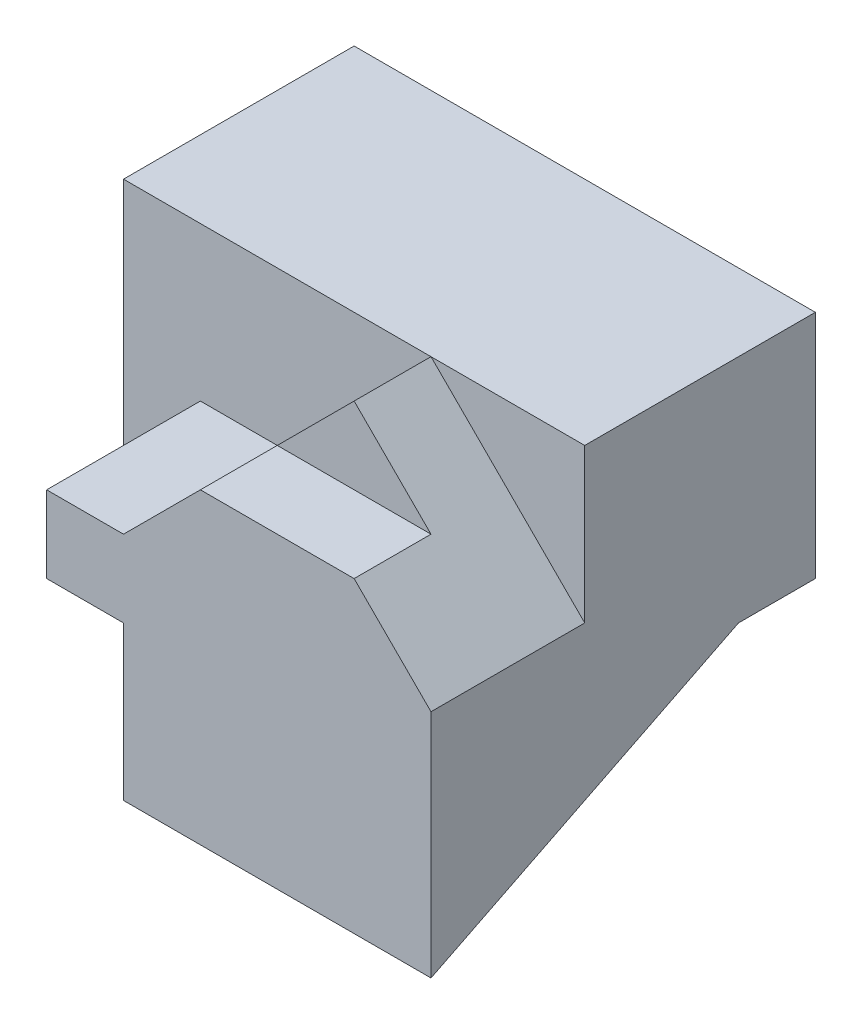
ISO-10303-21;
HEADER;
FILE_DESCRIPTION(('STEP AP214'),'2;1');
FILE_NAME('part.step','',(''),(''),'','','');
FILE_SCHEMA(('AUTOMOTIVE_DESIGN { 1 0 10303 214 1 1 1 1 }'));
ENDSEC;
DATA;
#1=APPLICATION_CONTEXT('core data for automotive mechanical design processes');
#2=APPLICATION_PROTOCOL_DEFINITION('international standard','automotive_design',2000,#1);
#3=PRODUCT_CONTEXT('',#1,'mechanical');
#4=PRODUCT('Part','Part','',(#3));
#5=PRODUCT_RELATED_PRODUCT_CATEGORY('part','',(#4));
#6=PRODUCT_DEFINITION_FORMATION('','',#4);
#7=PRODUCT_DEFINITION_CONTEXT('part definition',#1,'design');
#8=PRODUCT_DEFINITION('design','',#6,#7);
#9=PRODUCT_DEFINITION_SHAPE('','',#8);
#10=(LENGTH_UNIT() NAMED_UNIT(*) SI_UNIT(.MILLI.,.METRE.));
#11=(NAMED_UNIT(*) PLANE_ANGLE_UNIT() SI_UNIT($,.RADIAN.));
#12=(NAMED_UNIT(*) SI_UNIT($,.STERADIAN.) SOLID_ANGLE_UNIT());
#13=UNCERTAINTY_MEASURE_WITH_UNIT(LENGTH_MEASURE(1.E-05),#10,'distance_accuracy_value','');
#14=(GEOMETRIC_REPRESENTATION_CONTEXT(3) GLOBAL_UNCERTAINTY_ASSIGNED_CONTEXT((#13)) GLOBAL_UNIT_ASSIGNED_CONTEXT((#10,
#11,#12)) REPRESENTATION_CONTEXT('',''));
#15=CARTESIAN_POINT('',(0.,0.,0.));
#16=DIRECTION('',(0.,0.,1.));
#17=DIRECTION('',(1.,0.,0.));
#18=AXIS2_PLACEMENT_3D('',#15,#16,#17);
#19=CARTESIAN_POINT('',(0.,5.,5.));
#20=DIRECTION('',(0.,-1.,0.));
#21=DIRECTION('',(0.,0.,-1.));
#22=AXIS2_PLACEMENT_3D('',#19,#20,#21);
#23=PLANE('',#22);
#24=DIRECTION('',(-1.,0.,0.));
#25=VECTOR('',#24,1.);
#26=CARTESIAN_POINT('',(0.,5.,3.));
#27=LINE('',#26,#25);
#28=CARTESIAN_POINT('',(4.,5.,3.));
#29=VERTEX_POINT('',#28);
#30=CARTESIAN_POINT('',(0.,5.,3.));
#31=VERTEX_POINT('',#30);
#32=EDGE_CURVE('E196',#29,#31,#27,.T.);
#33=ORIENTED_EDGE('',*,*,#32,.F.);
#34=DIRECTION('',(-1.,0.,0.));
#35=VECTOR('',#34,1.);
#36=CARTESIAN_POINT('',(6.,5.,3.));
#37=LINE('',#36,#35);
#38=CARTESIAN_POINT('',(6.,5.,3.));
#39=VERTEX_POINT('',#38);
#40=EDGE_CURVE('E183',#39,#29,#37,.T.);
#41=ORIENTED_EDGE('',*,*,#40,.F.);
#42=DIRECTION('',(0.,0.,-1.));
#43=VECTOR('',#42,1.);
#44=CARTESIAN_POINT('',(6.,5.,5.));
#45=LINE('',#44,#43);
#46=CARTESIAN_POINT('',(6.,5.,0.));
#47=VERTEX_POINT('',#46);
#48=EDGE_CURVE('E263',#39,#47,#45,.T.);
#49=ORIENTED_EDGE('',*,*,#48,.T.);
#50=DIRECTION('',(-1.,0.,0.));
#51=VECTOR('',#50,1.);
#52=CARTESIAN_POINT('',(0.,5.,0.));
#53=LINE('',#52,#51);
#54=CARTESIAN_POINT('',(0.,5.,0.));
#55=VERTEX_POINT('',#54);
#56=EDGE_CURVE('E248',#47,#55,#53,.T.);
#57=ORIENTED_EDGE('',*,*,#56,.T.);
#58=DIRECTION('',(0.,0.,-1.));
#59=VECTOR('',#58,1.);
#60=CARTESIAN_POINT('',(0.,5.,5.));
#61=LINE('',#60,#59);
#62=EDGE_CURVE('E251',#31,#55,#61,.T.);
#63=ORIENTED_EDGE('',*,*,#62,.F.);
#64=EDGE_LOOP('',(#33,#41,#49,#57,#63));
#65=FACE_BOUND('',#64,.T.);
#66=ADVANCED_FACE('F33',(#65),#23,.F.);
#67=CARTESIAN_POINT('',(0.,0.,5.));
#68=DIRECTION('',(0.,1.,0.));
#69=DIRECTION('',(0.,0.,1.));
#70=AXIS2_PLACEMENT_3D('',#67,#68,#69);
#71=PLANE('',#70);
#72=DIRECTION('',(0.,0.,1.));
#73=VECTOR('',#72,1.);
#74=CARTESIAN_POINT('',(2.,0.,5.));
#75=LINE('',#74,#73);
#76=CARTESIAN_POINT('',(2.,0.,1.));
#77=VERTEX_POINT('',#76);
#78=CARTESIAN_POINT('',(2.,0.,5.));
#79=VERTEX_POINT('',#78);
#80=EDGE_CURVE('E207',#77,#79,#75,.T.);
#81=ORIENTED_EDGE('',*,*,#80,.F.);
#82=DIRECTION('',(-1.,0.,0.));
#83=VECTOR('',#82,1.);
#84=CARTESIAN_POINT('',(2.,0.,1.));
#85=LINE('',#84,#83);
#86=CARTESIAN_POINT('',(0.,0.,1.));
#87=VERTEX_POINT('',#86);
#88=EDGE_CURVE('E216',#77,#87,#85,.T.);
#89=ORIENTED_EDGE('',*,*,#88,.T.);
#90=DIRECTION('',(0.,0.,-1.));
#91=VECTOR('',#90,1.);
#92=CARTESIAN_POINT('',(0.,0.,5.));
#93=LINE('',#92,#91);
#94=CARTESIAN_POINT('',(0.,0.,0.));
#95=VERTEX_POINT('',#94);
#96=EDGE_CURVE('E265',#87,#95,#93,.T.);
#97=ORIENTED_EDGE('',*,*,#96,.T.);
#98=DIRECTION('',(1.,0.,0.));
#99=VECTOR('',#98,1.);
#100=CARTESIAN_POINT('',(0.,0.,0.));
#101=LINE('',#100,#99);
#102=CARTESIAN_POINT('',(4.,0.,0.));
#103=VERTEX_POINT('',#102);
#104=EDGE_CURVE('E254',#95,#103,#101,.T.);
#105=ORIENTED_EDGE('',*,*,#104,.T.);
#106=DIRECTION('',(0.,0.,-1.));
#107=VECTOR('',#106,1.);
#108=CARTESIAN_POINT('',(4.,0.,5.));
#109=LINE('',#108,#107);
#110=CARTESIAN_POINT('',(4.,0.,5.));
#111=VERTEX_POINT('',#110);
#112=EDGE_CURVE('E232',#111,#103,#109,.T.);
#113=ORIENTED_EDGE('',*,*,#112,.F.);
#114=DIRECTION('',(1.,0.,0.));
#115=VECTOR('',#114,1.);
#116=CARTESIAN_POINT('',(0.,0.,5.));
#117=LINE('',#116,#115);
#118=EDGE_CURVE('E245',#79,#111,#117,.T.);
#119=ORIENTED_EDGE('',*,*,#118,.F.);
#120=EDGE_LOOP('',(#81,#89,#97,#105,#113,#119));
#121=FACE_BOUND('',#120,.T.);
#122=ADVANCED_FACE('F300',(#121),#71,.F.);
#123=CARTESIAN_POINT('',(0.,0.,5.));
#124=DIRECTION('',(1.,0.,0.));
#125=DIRECTION('',(0.,0.,-1.));
#126=AXIS2_PLACEMENT_3D('',#123,#124,#125);
#127=PLANE('',#126);
#128=DIRECTION('',(0.,-0.447213595499958,-0.894427190999916));
#129=VECTOR('',#128,1.);
#130=CARTESIAN_POINT('',(0.,0.,1.));
#131=LINE('',#130,#129);
#132=CARTESIAN_POINT('',(0.,1.,3.));
#133=VERTEX_POINT('',#132);
#134=EDGE_CURVE('E203',#133,#87,#131,.T.);
#135=ORIENTED_EDGE('',*,*,#134,.F.);
#136=DIRECTION('',(0.,1.,0.));
#137=VECTOR('',#136,1.);
#138=CARTESIAN_POINT('',(0.,0.,3.));
#139=LINE('',#138,#137);
#140=EDGE_CURVE('E200',#133,#31,#139,.T.);
#141=ORIENTED_EDGE('',*,*,#140,.T.);
#142=ORIENTED_EDGE('',*,*,#62,.T.);
#143=DIRECTION('',(0.,-1.,0.));
#144=VECTOR('',#143,1.);
#145=CARTESIAN_POINT('',(0.,0.,0.));
#146=LINE('',#145,#144);
#147=EDGE_CURVE('E241',#55,#95,#146,.T.);
#148=ORIENTED_EDGE('',*,*,#147,.T.);
#149=ORIENTED_EDGE('',*,*,#96,.F.);
#150=EDGE_LOOP('',(#135,#141,#142,#148,#149));
#151=FACE_BOUND('',#150,.T.);
#152=ADVANCED_FACE('F35',(#151),#127,.F.);
#153=CARTESIAN_POINT('',(6.,0.,5.));
#154=DIRECTION('',(-1.,0.,0.));
#155=DIRECTION('',(0.,0.,1.));
#156=AXIS2_PLACEMENT_3D('',#153,#154,#155);
#157=PLANE('',#156);
#158=DIRECTION('',(0.,1.,0.));
#159=VECTOR('',#158,1.);
#160=CARTESIAN_POINT('',(6.,3.,3.));
#161=LINE('',#160,#159);
#162=CARTESIAN_POINT('',(6.,3.,3.));
#163=VERTEX_POINT('',#162);
#164=EDGE_CURVE('E189',#163,#39,#161,.T.);
#165=ORIENTED_EDGE('',*,*,#164,.F.);
#166=DIRECTION('',(0.,0.,1.));
#167=VECTOR('',#166,1.);
#168=CARTESIAN_POINT('',(6.,3.,3.));
#169=LINE('',#168,#167);
#170=CARTESIAN_POINT('',(6.,3.,5.));
#171=VERTEX_POINT('',#170);
#172=EDGE_CURVE('E193',#163,#171,#169,.T.);
#173=ORIENTED_EDGE('',*,*,#172,.T.);
#174=DIRECTION('',(0.,1.,0.));
#175=VECTOR('',#174,1.);
#176=CARTESIAN_POINT('',(6.,0.,5.));
#177=LINE('',#176,#175);
#178=CARTESIAN_POINT('',(6.,0.,5.));
#179=VERTEX_POINT('',#178);
#180=EDGE_CURVE('E247',#179,#171,#177,.T.);
#181=ORIENTED_EDGE('',*,*,#180,.F.);
#182=DIRECTION('',(0.,-0.447213595499958,0.894427190999916));
#183=VECTOR('',#182,1.);
#184=CARTESIAN_POINT('',(6.,2.,1.));
#185=LINE('',#184,#183);
#186=CARTESIAN_POINT('',(6.,2.,1.));
#187=VERTEX_POINT('',#186);
#188=EDGE_CURVE('E226',#187,#179,#185,.T.);
#189=ORIENTED_EDGE('',*,*,#188,.F.);
#190=DIRECTION('',(0.,0.,1.));
#191=VECTOR('',#190,1.);
#192=CARTESIAN_POINT('',(6.,2.,0.));
#193=LINE('',#192,#191);
#194=CARTESIAN_POINT('',(6.,2.,0.));
#195=VERTEX_POINT('',#194);
#196=EDGE_CURVE('E219',#195,#187,#193,.T.);
#197=ORIENTED_EDGE('',*,*,#196,.F.);
#198=DIRECTION('',(0.,1.,0.));
#199=VECTOR('',#198,1.);
#200=CARTESIAN_POINT('',(6.,0.,0.));
#201=LINE('',#200,#199);
#202=EDGE_CURVE('E257',#195,#47,#201,.T.);
#203=ORIENTED_EDGE('',*,*,#202,.T.);
#204=ORIENTED_EDGE('',*,*,#48,.F.);
#205=EDGE_LOOP('',(#165,#173,#181,#189,#197,#203,#204));
#206=FACE_BOUND('',#205,.T.);
#207=ADVANCED_FACE('F315',(#206),#157,.F.);
#208=CARTESIAN_POINT('',(0.,0.,5.));
#209=DIRECTION('',(0.,0.,-1.));
#210=DIRECTION('',(-1.,0.,0.));
#211=AXIS2_PLACEMENT_3D('',#208,#209,#210);
#212=PLANE('',#211);
#213=DIRECTION('',(0.707106781186548,-0.707106781186548,0.));
#214=VECTOR('',#213,1.);
#215=CARTESIAN_POINT('',(4.,5.,5.));
#216=LINE('',#215,#214);
#217=CARTESIAN_POINT('',(5.,4.,5.));
#218=VERTEX_POINT('',#217);
#219=EDGE_CURVE('E181',#218,#171,#216,.T.);
#220=ORIENTED_EDGE('',*,*,#219,.F.);
#221=DIRECTION('',(1.,0.,0.));
#222=VECTOR('',#221,1.);
#223=CARTESIAN_POINT('',(3.,4.,5.));
#224=LINE('',#223,#222);
#225=CARTESIAN_POINT('',(3.,4.,5.));
#226=VERTEX_POINT('',#225);
#227=EDGE_CURVE('E157',#226,#218,#224,.T.);
#228=ORIENTED_EDGE('',*,*,#227,.F.);
#229=DIRECTION('',(0.707106781186547,0.707106781186548,0.));
#230=VECTOR('',#229,1.);
#231=CARTESIAN_POINT('',(4.,5.,5.));
#232=LINE('',#231,#230);
#233=CARTESIAN_POINT('',(2.,3.,5.));
#234=VERTEX_POINT('',#233);
#235=EDGE_CURVE('E162',#234,#226,#232,.T.);
#236=ORIENTED_EDGE('',*,*,#235,.F.);
#237=DIRECTION('',(1.,0.,0.));
#238=VECTOR('',#237,1.);
#239=CARTESIAN_POINT('',(2.,3.,5.));
#240=LINE('',#239,#238);
#241=CARTESIAN_POINT('',(1.,3.,5.));
#242=VERTEX_POINT('',#241);
#243=EDGE_CURVE('E164',#242,#234,#240,.T.);
#244=ORIENTED_EDGE('',*,*,#243,.F.);
#245=DIRECTION('',(0.,1.,0.));
#246=VECTOR('',#245,1.);
#247=CARTESIAN_POINT('',(1.,0.,5.));
#248=LINE('',#247,#246);
#249=CARTESIAN_POINT('',(1.,2.,5.));
#250=VERTEX_POINT('',#249);
#251=EDGE_CURVE('E199',#250,#242,#248,.T.);
#252=ORIENTED_EDGE('',*,*,#251,.F.);
#253=DIRECTION('',(-1.,0.,0.));
#254=VECTOR('',#253,1.);
#255=CARTESIAN_POINT('',(2.,2.,5.));
#256=LINE('',#255,#254);
#257=CARTESIAN_POINT('',(2.,2.,5.));
#258=VERTEX_POINT('',#257);
#259=EDGE_CURVE('E214',#258,#250,#256,.T.);
#260=ORIENTED_EDGE('',*,*,#259,.F.);
#261=DIRECTION('',(0.,1.,0.));
#262=VECTOR('',#261,1.);
#263=CARTESIAN_POINT('',(2.,2.,5.));
#264=LINE('',#263,#262);
#265=EDGE_CURVE('E209',#79,#258,#264,.T.);
#266=ORIENTED_EDGE('',*,*,#265,.F.);
#267=ORIENTED_EDGE('',*,*,#118,.T.);
#268=DIRECTION('',(1.,0.,0.));
#269=VECTOR('',#268,1.);
#270=CARTESIAN_POINT('',(4.,0.,5.));
#271=LINE('',#270,#269);
#272=EDGE_CURVE('E238',#111,#179,#271,.T.);
#273=ORIENTED_EDGE('',*,*,#272,.T.);
#274=ORIENTED_EDGE('',*,*,#180,.T.);
#275=EDGE_LOOP('',(#220,#228,#236,#244,#252,#260,#266,#267,#273,#274));
#276=FACE_BOUND('',#275,.T.);
#277=ADVANCED_FACE('F277',(#276),#212,.F.);
#278=CARTESIAN_POINT('',(0.,0.,0.));
#279=DIRECTION('',(0.,0.,-1.));
#280=DIRECTION('',(-1.,0.,0.));
#281=AXIS2_PLACEMENT_3D('',#278,#279,#280);
#282=PLANE('',#281);
#283=DIRECTION('',(1.,0.,0.));
#284=VECTOR('',#283,1.);
#285=CARTESIAN_POINT('',(4.,2.,0.));
#286=LINE('',#285,#284);
#287=CARTESIAN_POINT('',(4.,2.,0.));
#288=VERTEX_POINT('',#287);
#289=EDGE_CURVE('E234',#288,#195,#286,.T.);
#290=ORIENTED_EDGE('',*,*,#289,.F.);
#291=DIRECTION('',(0.,1.,0.));
#292=VECTOR('',#291,1.);
#293=CARTESIAN_POINT('',(4.,0.,0.));
#294=LINE('',#293,#292);
#295=EDGE_CURVE('E222',#103,#288,#294,.T.);
#296=ORIENTED_EDGE('',*,*,#295,.F.);
#297=ORIENTED_EDGE('',*,*,#104,.F.);
#298=ORIENTED_EDGE('',*,*,#147,.F.);
#299=ORIENTED_EDGE('',*,*,#56,.F.);
#300=ORIENTED_EDGE('',*,*,#202,.F.);
#301=EDGE_LOOP('',(#290,#296,#297,#298,#299,#300));
#302=FACE_BOUND('',#301,.T.);
#303=ADVANCED_FACE('F296',(#302),#282,.T.);
#304=CARTESIAN_POINT('',(4.,2.,1.));
#305=DIRECTION('',(0.,0.894427190999916,0.447213595499958));
#306=DIRECTION('',(0.,-0.447213595499958,0.894427190999916));
#307=AXIS2_PLACEMENT_3D('',#304,#305,#306);
#308=PLANE('',#307);
#309=ORIENTED_EDGE('',*,*,#188,.T.);
#310=ORIENTED_EDGE('',*,*,#272,.F.);
#311=DIRECTION('',(0.,-0.447213595499958,0.894427190999916));
#312=VECTOR('',#311,1.);
#313=CARTESIAN_POINT('',(4.,2.,1.));
#314=LINE('',#313,#312);
#315=CARTESIAN_POINT('',(4.,2.,1.));
#316=VERTEX_POINT('',#315);
#317=EDGE_CURVE('E229',#316,#111,#314,.T.);
#318=ORIENTED_EDGE('',*,*,#317,.F.);
#319=DIRECTION('',(1.,0.,0.));
#320=VECTOR('',#319,1.);
#321=CARTESIAN_POINT('',(4.,2.,1.));
#322=LINE('',#321,#320);
#323=EDGE_CURVE('E242',#316,#187,#322,.T.);
#324=ORIENTED_EDGE('',*,*,#323,.T.);
#325=EDGE_LOOP('',(#309,#310,#318,#324));
#326=FACE_BOUND('',#325,.T.);
#327=ADVANCED_FACE('F318',(#326),#308,.F.);
#328=CARTESIAN_POINT('',(4.,2.,0.));
#329=DIRECTION('',(0.,1.,0.));
#330=DIRECTION('',(0.,0.,1.));
#331=AXIS2_PLACEMENT_3D('',#328,#329,#330);
#332=PLANE('',#331);
#333=ORIENTED_EDGE('',*,*,#196,.T.);
#334=ORIENTED_EDGE('',*,*,#323,.F.);
#335=DIRECTION('',(0.,0.,1.));
#336=VECTOR('',#335,1.);
#337=CARTESIAN_POINT('',(4.,2.,0.));
#338=LINE('',#337,#336);
#339=EDGE_CURVE('E225',#288,#316,#338,.T.);
#340=ORIENTED_EDGE('',*,*,#339,.F.);
#341=ORIENTED_EDGE('',*,*,#289,.T.);
#342=EDGE_LOOP('',(#333,#334,#340,#341));
#343=FACE_BOUND('',#342,.T.);
#344=ADVANCED_FACE('F311',(#343),#332,.F.);
#345=CARTESIAN_POINT('',(4.,0.,0.));
#346=DIRECTION('',(1.,0.,0.));
#347=DIRECTION('',(0.,0.,-1.));
#348=AXIS2_PLACEMENT_3D('',#345,#346,#347);
#349=PLANE('',#348);
#350=ORIENTED_EDGE('',*,*,#295,.T.);
#351=ORIENTED_EDGE('',*,*,#339,.T.);
#352=ORIENTED_EDGE('',*,*,#317,.T.);
#353=ORIENTED_EDGE('',*,*,#112,.T.);
#354=EDGE_LOOP('',(#350,#351,#352,#353));
#355=FACE_BOUND('',#354,.T.);
#356=ADVANCED_FACE('F307',(#355),#349,.T.);
#357=CARTESIAN_POINT('',(2.,0.,1.));
#358=DIRECTION('',(0.,0.894427190999916,-0.447213595499958));
#359=DIRECTION('',(0.,0.447213595499958,0.894427190999916));
#360=AXIS2_PLACEMENT_3D('',#357,#358,#359);
#361=PLANE('',#360);
#362=DIRECTION('',(0.,-0.447213595499958,-0.894427190999916));
#363=VECTOR('',#362,1.);
#364=CARTESIAN_POINT('',(1.,0.,1.));
#365=LINE('',#364,#363);
#366=CARTESIAN_POINT('',(1.,1.,3.));
#367=VERTEX_POINT('',#366);
#368=EDGE_CURVE('E41',#250,#367,#365,.T.);
#369=ORIENTED_EDGE('',*,*,#368,.T.);
#370=DIRECTION('',(-1.,0.,0.));
#371=VECTOR('',#370,1.);
#372=CARTESIAN_POINT('',(2.,1.,3.));
#373=LINE('',#372,#371);
#374=EDGE_CURVE('E11',#367,#133,#373,.T.);
#375=ORIENTED_EDGE('',*,*,#374,.T.);
#376=ORIENTED_EDGE('',*,*,#134,.T.);
#377=ORIENTED_EDGE('',*,*,#88,.F.);
#378=DIRECTION('',(0.,-0.447213595499958,-0.894427190999916));
#379=VECTOR('',#378,1.);
#380=CARTESIAN_POINT('',(2.,0.,1.));
#381=LINE('',#380,#379);
#382=EDGE_CURVE('E211',#258,#77,#381,.T.);
#383=ORIENTED_EDGE('',*,*,#382,.F.);
#384=ORIENTED_EDGE('',*,*,#259,.T.);
#385=EDGE_LOOP('',(#369,#375,#376,#377,#383,#384));
#386=FACE_BOUND('',#385,.T.);
#387=ADVANCED_FACE('F268',(#386),#361,.F.);
#388=CARTESIAN_POINT('',(2.,0.,0.));
#389=DIRECTION('',(-1.,0.,0.));
#390=DIRECTION('',(0.,0.,1.));
#391=AXIS2_PLACEMENT_3D('',#388,#389,#390);
#392=PLANE('',#391);
#393=ORIENTED_EDGE('',*,*,#80,.T.);
#394=ORIENTED_EDGE('',*,*,#265,.T.);
#395=ORIENTED_EDGE('',*,*,#382,.T.);
#396=EDGE_LOOP('',(#393,#394,#395));
#397=FACE_BOUND('',#396,.T.);
#398=ADVANCED_FACE('F304',(#397),#392,.T.);
#399=CARTESIAN_POINT('',(0.,0.,3.));
#400=DIRECTION('',(0.,0.,-1.));
#401=DIRECTION('',(-1.,0.,0.));
#402=AXIS2_PLACEMENT_3D('',#399,#400,#401);
#403=PLANE('',#402);
#404=DIRECTION('',(0.,1.,0.));
#405=VECTOR('',#404,1.);
#406=CARTESIAN_POINT('',(1.,0.,3.));
#407=LINE('',#406,#405);
#408=CARTESIAN_POINT('',(1.,3.,3.));
#409=VERTEX_POINT('',#408);
#410=EDGE_CURVE('E56',#367,#409,#407,.T.);
#411=ORIENTED_EDGE('',*,*,#410,.T.);
#412=DIRECTION('',(1.,0.,0.));
#413=VECTOR('',#412,1.);
#414=CARTESIAN_POINT('',(2.,3.,3.));
#415=LINE('',#414,#413);
#416=CARTESIAN_POINT('',(2.,3.,3.));
#417=VERTEX_POINT('',#416);
#418=EDGE_CURVE('E169',#409,#417,#415,.T.);
#419=ORIENTED_EDGE('',*,*,#418,.T.);
#420=DIRECTION('',(0.707106781186547,0.707106781186548,0.));
#421=VECTOR('',#420,1.);
#422=CARTESIAN_POINT('',(4.,5.,3.));
#423=LINE('',#422,#421);
#424=EDGE_CURVE('E172',#417,#29,#423,.T.);
#425=ORIENTED_EDGE('',*,*,#424,.T.);
#426=ORIENTED_EDGE('',*,*,#32,.T.);
#427=ORIENTED_EDGE('',*,*,#140,.F.);
#428=ORIENTED_EDGE('',*,*,#374,.F.);
#429=EDGE_LOOP('',(#411,#419,#425,#426,#427,#428));
#430=FACE_BOUND('',#429,.T.);
#431=ADVANCED_FACE('F282',(#430),#403,.F.);
#432=CARTESIAN_POINT('',(1.,0.,5.));
#433=DIRECTION('',(1.,0.,0.));
#434=DIRECTION('',(0.,0.,-1.));
#435=AXIS2_PLACEMENT_3D('',#432,#433,#434);
#436=PLANE('',#435);
#437=ORIENTED_EDGE('',*,*,#251,.T.);
#438=DIRECTION('',(0.,0.,1.));
#439=VECTOR('',#438,1.);
#440=CARTESIAN_POINT('',(1.,3.,3.));
#441=LINE('',#440,#439);
#442=EDGE_CURVE('E175',#409,#242,#441,.T.);
#443=ORIENTED_EDGE('',*,*,#442,.F.);
#444=ORIENTED_EDGE('',*,*,#410,.F.);
#445=ORIENTED_EDGE('',*,*,#368,.F.);
#446=EDGE_LOOP('',(#437,#443,#444,#445));
#447=FACE_BOUND('',#446,.T.);
#448=ADVANCED_FACE('F273',(#447),#436,.F.);
#449=CARTESIAN_POINT('',(4.,5.,3.));
#450=DIRECTION('',(-0.707106781186547,-0.707106781186547,0.));
#451=DIRECTION('',(0.707106781186548,-0.707106781186548,0.));
#452=AXIS2_PLACEMENT_3D('',#449,#450,#451);
#453=PLANE('',#452);
#454=DIRECTION('',(-0.707106781186548,0.707106781186548,0.));
#455=VECTOR('',#454,1.);
#456=CARTESIAN_POINT('',(5.,4.,4.));
#457=LINE('',#456,#455);
#458=CARTESIAN_POINT('',(5.,4.,4.));
#459=VERTEX_POINT('',#458);
#460=CARTESIAN_POINT('',(4.,5.,4.));
#461=VERTEX_POINT('',#460);
#462=EDGE_CURVE('E48',#459,#461,#457,.T.);
#463=ORIENTED_EDGE('',*,*,#462,.F.);
#464=DIRECTION('',(0.,0.,1.));
#465=VECTOR('',#464,1.);
#466=CARTESIAN_POINT('',(5.,4.,4.));
#467=LINE('',#466,#465);
#468=EDGE_CURVE('E150',#459,#218,#467,.T.);
#469=ORIENTED_EDGE('',*,*,#468,.T.);
#470=ORIENTED_EDGE('',*,*,#219,.T.);
#471=ORIENTED_EDGE('',*,*,#172,.F.);
#472=DIRECTION('',(0.707106781186548,-0.707106781186548,0.));
#473=VECTOR('',#472,1.);
#474=CARTESIAN_POINT('',(4.,5.,3.));
#475=LINE('',#474,#473);
#476=EDGE_CURVE('E186',#29,#163,#475,.T.);
#477=ORIENTED_EDGE('',*,*,#476,.F.);
#478=DIRECTION('',(0.,0.,1.));
#479=VECTOR('',#478,1.);
#480=CARTESIAN_POINT('',(4.,5.,3.));
#481=LINE('',#480,#479);
#482=EDGE_CURVE('E191',#29,#461,#481,.T.);
#483=ORIENTED_EDGE('',*,*,#482,.T.);
#484=EDGE_LOOP('',(#463,#469,#470,#471,#477,#483));
#485=FACE_BOUND('',#484,.T.);
#486=ADVANCED_FACE('F320',(#485),#453,.F.);
#487=CARTESIAN_POINT('',(0.,0.,3.));
#488=DIRECTION('',(0.,0.,-1.));
#489=DIRECTION('',(-1.,0.,0.));
#490=AXIS2_PLACEMENT_3D('',#487,#488,#489);
#491=PLANE('',#490);
#492=ORIENTED_EDGE('',*,*,#40,.T.);
#493=ORIENTED_EDGE('',*,*,#476,.T.);
#494=ORIENTED_EDGE('',*,*,#164,.T.);
#495=EDGE_LOOP('',(#492,#493,#494));
#496=FACE_BOUND('',#495,.T.);
#497=ADVANCED_FACE('F323',(#496),#491,.F.);
#498=CARTESIAN_POINT('',(4.,5.,3.));
#499=DIRECTION('',(0.707106781186548,-0.707106781186547,0.));
#500=DIRECTION('',(0.707106781186547,0.707106781186548,0.));
#501=AXIS2_PLACEMENT_3D('',#498,#499,#500);
#502=PLANE('',#501);
#503=ORIENTED_EDGE('',*,*,#235,.T.);
#504=DIRECTION('',(0.,0.,1.));
#505=VECTOR('',#504,1.);
#506=CARTESIAN_POINT('',(3.,4.,4.));
#507=LINE('',#506,#505);
#508=CARTESIAN_POINT('',(3.,4.,4.));
#509=VERTEX_POINT('',#508);
#510=EDGE_CURVE('E147',#509,#226,#507,.T.);
#511=ORIENTED_EDGE('',*,*,#510,.F.);
#512=DIRECTION('',(-0.707106781186547,-0.707106781186548,0.));
#513=VECTOR('',#512,1.);
#514=CARTESIAN_POINT('',(4.,5.,4.));
#515=LINE('',#514,#513);
#516=EDGE_CURVE('E151',#461,#509,#515,.T.);
#517=ORIENTED_EDGE('',*,*,#516,.F.);
#518=ORIENTED_EDGE('',*,*,#482,.F.);
#519=ORIENTED_EDGE('',*,*,#424,.F.);
#520=DIRECTION('',(0.,0.,1.));
#521=VECTOR('',#520,1.);
#522=CARTESIAN_POINT('',(2.,3.,3.));
#523=LINE('',#522,#521);
#524=EDGE_CURVE('E179',#417,#234,#523,.T.);
#525=ORIENTED_EDGE('',*,*,#524,.T.);
#526=EDGE_LOOP('',(#503,#511,#517,#518,#519,#525));
#527=FACE_BOUND('',#526,.T.);
#528=ADVANCED_FACE('F160',(#527),#502,.F.);
#529=CARTESIAN_POINT('',(2.,3.,3.));
#530=DIRECTION('',(0.,-1.,0.));
#531=DIRECTION('',(1.,0.,0.));
#532=AXIS2_PLACEMENT_3D('',#529,#530,#531);
#533=PLANE('',#532);
#534=ORIENTED_EDGE('',*,*,#243,.T.);
#535=ORIENTED_EDGE('',*,*,#524,.F.);
#536=ORIENTED_EDGE('',*,*,#418,.F.);
#537=ORIENTED_EDGE('',*,*,#442,.T.);
#538=EDGE_LOOP('',(#534,#535,#536,#537));
#539=FACE_BOUND('',#538,.T.);
#540=ADVANCED_FACE('F280',(#539),#533,.F.);
#541=CARTESIAN_POINT('',(3.,4.,4.));
#542=DIRECTION('',(0.,-1.,0.));
#543=DIRECTION('',(0.,0.,-1.));
#544=AXIS2_PLACEMENT_3D('',#541,#542,#543);
#545=PLANE('',#544);
#546=ORIENTED_EDGE('',*,*,#227,.T.);
#547=ORIENTED_EDGE('',*,*,#468,.F.);
#548=DIRECTION('',(1.,0.,0.));
#549=VECTOR('',#548,1.);
#550=CARTESIAN_POINT('',(3.,4.,4.));
#551=LINE('',#550,#549);
#552=EDGE_CURVE('E144',#509,#459,#551,.T.);
#553=ORIENTED_EDGE('',*,*,#552,.F.);
#554=ORIENTED_EDGE('',*,*,#510,.T.);
#555=EDGE_LOOP('',(#546,#547,#553,#554));
#556=FACE_BOUND('',#555,.T.);
#557=ADVANCED_FACE('F145',(#556),#545,.F.);
#558=CARTESIAN_POINT('',(0.,0.,4.));
#559=DIRECTION('',(0.,0.,-1.));
#560=DIRECTION('',(-1.,0.,0.));
#561=AXIS2_PLACEMENT_3D('',#558,#559,#560);
#562=PLANE('',#561);
#563=ORIENTED_EDGE('',*,*,#516,.T.);
#564=ORIENTED_EDGE('',*,*,#552,.T.);
#565=ORIENTED_EDGE('',*,*,#462,.T.);
#566=EDGE_LOOP('',(#563,#564,#565));
#567=FACE_BOUND('',#566,.T.);
#568=ADVANCED_FACE('F153',(#567),#562,.F.);
#569=CLOSED_SHELL('',(#66,#122,#152,#207,#277,#303,#327,#344,#356,#387,#398,#431,#448,#486,#497,
#528,#540,#557,#568));
#570=MANIFOLD_SOLID_BREP('B2',#569);
#571=ADVANCED_BREP_SHAPE_REPRESENTATION('',(#18,#570),#14);
#572=SHAPE_DEFINITION_REPRESENTATION(#9,#571);
ENDSEC;
END-ISO-10303-21;
